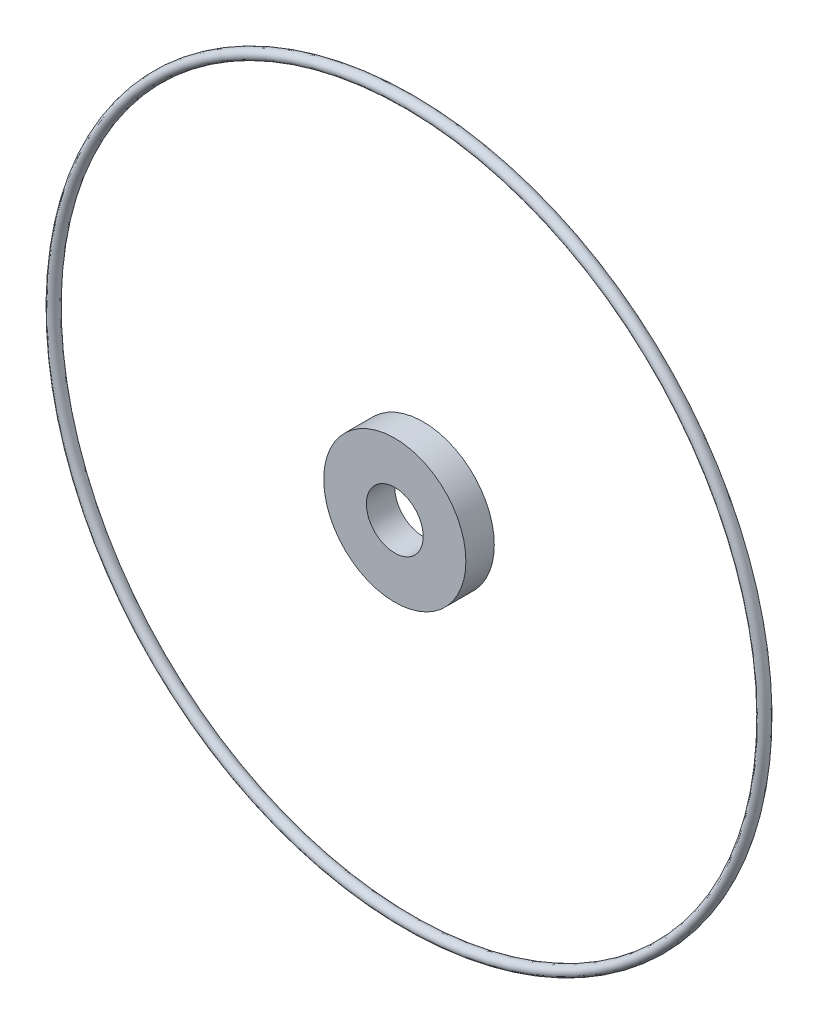
ISO-10303-21;
HEADER;
FILE_DESCRIPTION(('STEP AP214'),'2;1');
FILE_NAME('part.step','',(''),(''),'','','');
FILE_SCHEMA(('AUTOMOTIVE_DESIGN { 1 0 10303 214 1 1 1 1 }'));
ENDSEC;
DATA;
#1=APPLICATION_CONTEXT('core data for automotive mechanical design processes');
#2=APPLICATION_PROTOCOL_DEFINITION('international standard','automotive_design',2000,#1);
#3=PRODUCT_CONTEXT('',#1,'mechanical');
#4=PRODUCT('Part','Part','',(#3));
#5=PRODUCT_RELATED_PRODUCT_CATEGORY('part','',(#4));
#6=PRODUCT_DEFINITION_FORMATION('','',#4);
#7=PRODUCT_DEFINITION_CONTEXT('part definition',#1,'design');
#8=PRODUCT_DEFINITION('design','',#6,#7);
#9=PRODUCT_DEFINITION_SHAPE('','',#8);
#10=(LENGTH_UNIT() NAMED_UNIT(*) SI_UNIT(.MILLI.,.METRE.));
#11=(NAMED_UNIT(*) PLANE_ANGLE_UNIT() SI_UNIT($,.RADIAN.));
#12=(NAMED_UNIT(*) SI_UNIT($,.STERADIAN.) SOLID_ANGLE_UNIT());
#13=UNCERTAINTY_MEASURE_WITH_UNIT(LENGTH_MEASURE(1.E-05),#10,'distance_accuracy_value','');
#14=(GEOMETRIC_REPRESENTATION_CONTEXT(3) GLOBAL_UNCERTAINTY_ASSIGNED_CONTEXT((#13)) GLOBAL_UNIT_ASSIGNED_CONTEXT((#10,
#11,#12)) REPRESENTATION_CONTEXT('',''));
#15=CARTESIAN_POINT('',(0.,0.,0.));
#16=DIRECTION('',(0.,0.,1.));
#17=DIRECTION('',(1.,0.,0.));
#18=AXIS2_PLACEMENT_3D('',#15,#16,#17);
#19=CARTESIAN_POINT('',(0.,0.,-10.));
#20=DIRECTION('',(0.,0.,1.));
#21=DIRECTION('',(1.,0.,0.));
#22=AXIS2_PLACEMENT_3D('',#19,#20,#21);
#23=CYLINDRICAL_SURFACE('',#22,50.);
#24=CARTESIAN_POINT('',(0.,0.,-10.));
#25=DIRECTION('',(0.,0.,1.));
#26=DIRECTION('',(1.,0.,0.));
#27=AXIS2_PLACEMENT_3D('',#24,#25,#26);
#28=CIRCLE('',#27,50.);
#29=CARTESIAN_POINT('',(50.,0.,-10.));
#30=VERTEX_POINT('',#29);
#31=EDGE_CURVE('E11',#30,#30,#28,.T.);
#32=ORIENTED_EDGE('',*,*,#31,.T.);
#33=EDGE_LOOP('',(#32));
#34=FACE_BOUND('',#33,.T.);
#35=CARTESIAN_POINT('',(0.,0.,10.));
#36=DIRECTION('',(0.,0.,1.));
#37=DIRECTION('',(1.,0.,0.));
#38=AXIS2_PLACEMENT_3D('',#35,#36,#37);
#39=CIRCLE('',#38,50.);
#40=CARTESIAN_POINT('',(50.,0.,10.));
#41=VERTEX_POINT('',#40);
#42=EDGE_CURVE('E46',#41,#41,#39,.T.);
#43=ORIENTED_EDGE('',*,*,#42,.F.);
#44=EDGE_LOOP('',(#43));
#45=FACE_BOUND('',#44,.T.);
#46=ADVANCED_FACE('F36',(#34,#45),#23,.T.);
#47=CARTESIAN_POINT('',(0.,0.,-10.));
#48=DIRECTION('',(0.,0.,1.));
#49=DIRECTION('',(1.,0.,0.));
#50=AXIS2_PLACEMENT_3D('',#47,#48,#49);
#51=PLANE('',#50);
#52=CARTESIAN_POINT('',(0.,0.,-10.));
#53=DIRECTION('',(0.,0.,1.));
#54=DIRECTION('',(1.,0.,0.));
#55=AXIS2_PLACEMENT_3D('',#52,#53,#54);
#56=CIRCLE('',#55,20.);
#57=CARTESIAN_POINT('',(20.,0.,-10.));
#58=VERTEX_POINT('',#57);
#59=EDGE_CURVE('E42',#58,#58,#56,.T.);
#60=ORIENTED_EDGE('',*,*,#59,.T.);
#61=EDGE_LOOP('',(#60));
#62=FACE_BOUND('',#61,.T.);
#63=ORIENTED_EDGE('',*,*,#31,.F.);
#64=EDGE_LOOP('',(#63));
#65=FACE_BOUND('',#64,.T.);
#66=ADVANCED_FACE('F65',(#62,#65),#51,.F.);
#67=CARTESIAN_POINT('',(0.,0.,-10.));
#68=DIRECTION('',(0.,0.,1.));
#69=DIRECTION('',(1.,0.,0.));
#70=AXIS2_PLACEMENT_3D('',#67,#68,#69);
#71=CYLINDRICAL_SURFACE('',#70,20.);
#72=ORIENTED_EDGE('',*,*,#59,.F.);
#73=EDGE_LOOP('',(#72));
#74=FACE_BOUND('',#73,.T.);
#75=CARTESIAN_POINT('',(0.,0.,10.));
#76=DIRECTION('',(0.,0.,1.));
#77=DIRECTION('',(1.,0.,0.));
#78=AXIS2_PLACEMENT_3D('',#75,#76,#77);
#79=CIRCLE('',#78,20.);
#80=CARTESIAN_POINT('',(20.,0.,10.));
#81=VERTEX_POINT('',#80);
#82=EDGE_CURVE('E50',#81,#81,#79,.T.);
#83=ORIENTED_EDGE('',*,*,#82,.T.);
#84=EDGE_LOOP('',(#83));
#85=FACE_BOUND('',#84,.T.);
#86=ADVANCED_FACE('F56',(#74,#85),#71,.F.);
#87=CARTESIAN_POINT('',(0.,0.,10.));
#88=DIRECTION('',(0.,0.,1.));
#89=DIRECTION('',(1.,0.,0.));
#90=AXIS2_PLACEMENT_3D('',#87,#88,#89);
#91=PLANE('',#90);
#92=ORIENTED_EDGE('',*,*,#42,.T.);
#93=EDGE_LOOP('',(#92));
#94=FACE_BOUND('',#93,.T.);
#95=ORIENTED_EDGE('',*,*,#82,.F.);
#96=EDGE_LOOP('',(#95));
#97=FACE_BOUND('',#96,.T.);
#98=ADVANCED_FACE('F58',(#94,#97),#91,.T.);
#99=CLOSED_SHELL('',(#46,#66,#86,#98));
#100=MANIFOLD_SOLID_BREP('B2',#99);
#101=CARTESIAN_POINT('',(114.613729321843,222.179416352954,0.));
#102=DIRECTION('',(1.,0.,0.));
#103=DIRECTION('',(0.,0.,-1.));
#104=AXIS2_PLACEMENT_3D('',#101,#102,#103);
#105=CIRCLE('',#104,4.);
#106=CARTESIAN_POINT('',(0.,0.,0.));
#107=DIRECTION('',(0.,0.,-1.));
#108=AXIS1_PLACEMENT('',#106,#107);
#109=SURFACE_OF_REVOLUTION('',#105,#108);
#110=ADVANCED_FACE('F98',(),#109,.F.);
#111=CLOSED_SHELL('',(#110));
#112=MANIFOLD_SOLID_BREP('B6',#111);
#113=ADVANCED_BREP_SHAPE_REPRESENTATION('',(#18,#100,#112),#14);
#114=SHAPE_DEFINITION_REPRESENTATION(#9,#113);
ENDSEC;
END-ISO-10303-21;
